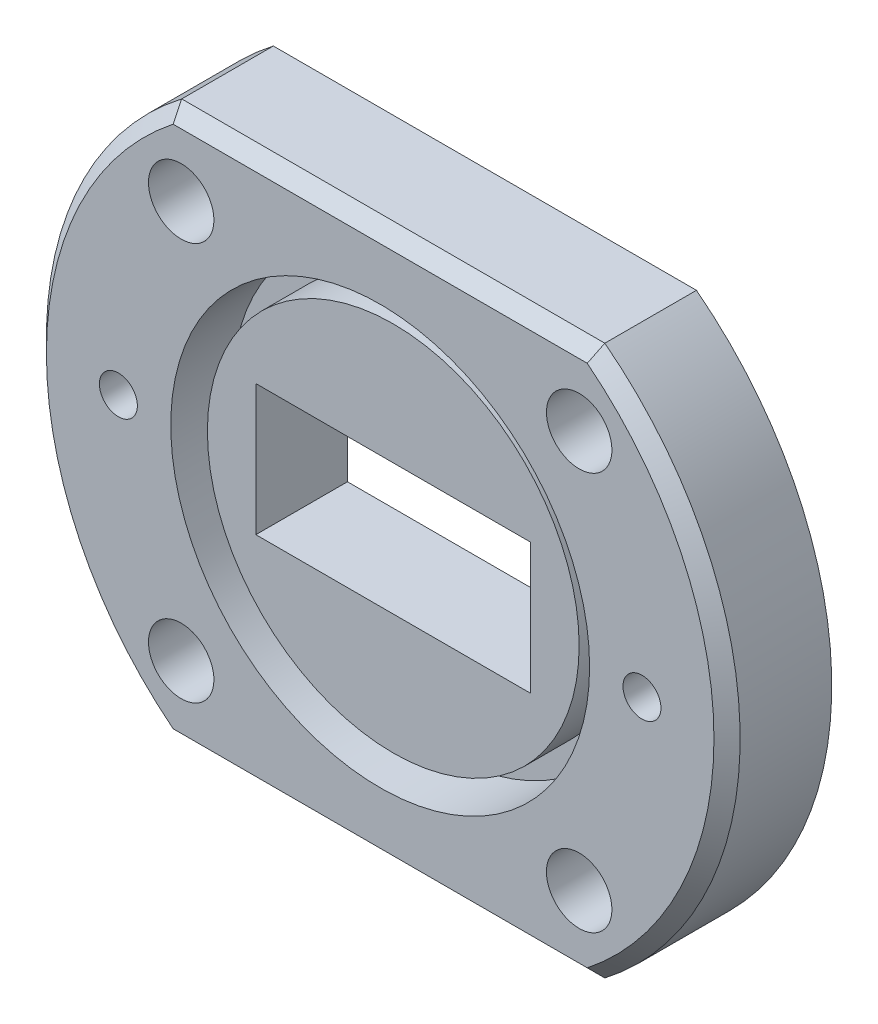
ISO-10303-21;
HEADER;
FILE_DESCRIPTION(('STEP AP214'),'2;1');
FILE_NAME('part.step','',(''),(''),'','','');
FILE_SCHEMA(('AUTOMOTIVE_DESIGN { 1 0 10303 214 1 1 1 1 }'));
ENDSEC;
DATA;
#1=APPLICATION_CONTEXT('core data for automotive mechanical design processes');
#2=APPLICATION_PROTOCOL_DEFINITION('international standard','automotive_design',2000,#1);
#3=PRODUCT_CONTEXT('',#1,'mechanical');
#4=PRODUCT('Part','Part','',(#3));
#5=PRODUCT_RELATED_PRODUCT_CATEGORY('part','',(#4));
#6=PRODUCT_DEFINITION_FORMATION('','',#4);
#7=PRODUCT_DEFINITION_CONTEXT('part definition',#1,'design');
#8=PRODUCT_DEFINITION('design','',#6,#7);
#9=PRODUCT_DEFINITION_SHAPE('','',#8);
#10=(LENGTH_UNIT() NAMED_UNIT(*) SI_UNIT(.MILLI.,.METRE.));
#11=(NAMED_UNIT(*) PLANE_ANGLE_UNIT() SI_UNIT($,.RADIAN.));
#12=(NAMED_UNIT(*) SI_UNIT($,.STERADIAN.) SOLID_ANGLE_UNIT());
#13=UNCERTAINTY_MEASURE_WITH_UNIT(LENGTH_MEASURE(1.E-05),#10,'distance_accuracy_value','');
#14=(GEOMETRIC_REPRESENTATION_CONTEXT(3) GLOBAL_UNCERTAINTY_ASSIGNED_CONTEXT((#13)) GLOBAL_UNIT_ASSIGNED_CONTEXT((#10,
#11,#12)) REPRESENTATION_CONTEXT('',''));
#15=CARTESIAN_POINT('',(0.,0.,0.));
#16=DIRECTION('',(0.,0.,1.));
#17=DIRECTION('',(1.,0.,0.));
#18=AXIS2_PLACEMENT_3D('',#15,#16,#17);
#19=CARTESIAN_POINT('',(0.,0.,8.));
#20=DIRECTION('',(0.,0.,-1.));
#21=DIRECTION('',(-1.,0.,0.));
#22=AXIS2_PLACEMENT_3D('',#19,#20,#21);
#23=CYLINDRICAL_SURFACE('',#22,26.5);
#24=CARTESIAN_POINT('',(0.,0.,7.00000000000001));
#25=DIRECTION('',(0.,0.,1.));
#26=DIRECTION('',(1.,0.,0.));
#27=AXIS2_PLACEMENT_3D('',#24,#25,#26);
#28=CIRCLE('',#27,26.5);
#29=CARTESIAN_POINT('',(16.1632298752446,21.,7.00000000000001));
#30=VERTEX_POINT('',#29);
#31=CARTESIAN_POINT('',(16.1632298752446,-21.,7.00000000000001));
#32=VERTEX_POINT('',#31);
#33=EDGE_CURVE('E136',#30,#32,#28,.F.);
#34=ORIENTED_EDGE('',*,*,#33,.T.);
#35=DIRECTION('',(0.,0.,-1.));
#36=VECTOR('',#35,1.);
#37=CARTESIAN_POINT('',(16.1632298752446,-21.,8.));
#38=LINE('',#37,#36);
#39=CARTESIAN_POINT('',(16.1632298752446,-21.,0.));
#40=VERTEX_POINT('',#39);
#41=EDGE_CURVE('E134',#32,#40,#38,.T.);
#42=ORIENTED_EDGE('',*,*,#41,.T.);
#43=CARTESIAN_POINT('',(0.,0.,0.));
#44=DIRECTION('',(0.,0.,1.));
#45=DIRECTION('',(1.,0.,0.));
#46=AXIS2_PLACEMENT_3D('',#43,#44,#45);
#47=CIRCLE('',#46,26.5);
#48=CARTESIAN_POINT('',(16.1632298752446,21.,0.));
#49=VERTEX_POINT('',#48);
#50=EDGE_CURVE('E202',#40,#49,#47,.T.);
#51=ORIENTED_EDGE('',*,*,#50,.T.);
#52=DIRECTION('',(0.,0.,-1.));
#53=VECTOR('',#52,1.);
#54=CARTESIAN_POINT('',(16.1632298752446,21.,8.));
#55=LINE('',#54,#53);
#56=EDGE_CURVE('E197',#49,#30,#55,.F.);
#57=ORIENTED_EDGE('',*,*,#56,.T.);
#58=EDGE_LOOP('',(#34,#42,#51,#57));
#59=FACE_BOUND('',#58,.T.);
#60=ADVANCED_FACE('F38',(#59),#23,.T.);
#61=CARTESIAN_POINT('',(0.,0.,8.));
#62=DIRECTION('',(0.,0.,-1.));
#63=DIRECTION('',(-1.,0.,0.));
#64=AXIS2_PLACEMENT_3D('',#61,#62,#63);
#65=CONICAL_SURFACE('',#64,25.5,0.785398163397447);
#66=CARTESIAN_POINT('',(0.,0.,8.));
#67=DIRECTION('',(0.,0.,1.));
#68=DIRECTION('',(1.,0.,0.));
#69=AXIS2_PLACEMENT_3D('',#66,#67,#68);
#70=CIRCLE('',#69,25.5);
#71=CARTESIAN_POINT('',(15.8192920195564,-20.,8.));
#72=VERTEX_POINT('',#71);
#73=CARTESIAN_POINT('',(15.8192920195564,20.,8.));
#74=VERTEX_POINT('',#73);
#75=EDGE_CURVE('E154',#72,#74,#70,.T.);
#76=ORIENTED_EDGE('',*,*,#75,.F.);
#77=CARTESIAN_POINT('',(15.8192920195564,-20.,8.));
#78=CARTESIAN_POINT('',(15.8771970048923,-20.166566584311,7.83343341568894));
#79=CARTESIAN_POINT('',(15.934810986366,-20.3331832122443,7.66681678775571));
#80=CARTESIAN_POINT('',(16.0494569382279,-20.6665165455835,7.33348345441651));
#81=CARTESIAN_POINT('',(16.1064889086503,-20.8332332509836,7.16676674901641));
#82=CARTESIAN_POINT('',(16.1632298752446,-21.,7.));
#83=B_SPLINE_CURVE_WITH_KNOTS('',3,(#77,#78,#79,#80,#81,#82),.UNSPECIFIED.,.F.,.F.,(4,2,4),(0.,
0.727718455462264,1.45543686825852),.UNSPECIFIED.);
#84=EDGE_CURVE('E47',#72,#32,#83,.T.);
#85=ORIENTED_EDGE('',*,*,#84,.T.);
#86=ORIENTED_EDGE('',*,*,#33,.F.);
#87=CARTESIAN_POINT('',(16.1632298752446,21.,7.));
#88=CARTESIAN_POINT('',(16.1064889086503,20.8332332509836,7.16676674901641));
#89=CARTESIAN_POINT('',(16.0494569382279,20.6665165455835,7.33348345441651));
#90=CARTESIAN_POINT('',(15.934810986366,20.3331832122443,7.66681678775571));
#91=CARTESIAN_POINT('',(15.8771970048923,20.166566584311,7.83343341568895));
#92=CARTESIAN_POINT('',(15.8192920195564,20.,8.));
#93=B_SPLINE_CURVE_WITH_KNOTS('',3,(#87,#88,#89,#90,#91,#92),.UNSPECIFIED.,.F.,.F.,(4,2,4),(0.,
0.727718412796261,1.45543686825852),.UNSPECIFIED.);
#94=EDGE_CURVE('E54',#30,#74,#93,.T.);
#95=ORIENTED_EDGE('',*,*,#94,.T.);
#96=EDGE_LOOP('',(#76,#85,#86,#95));
#97=FACE_BOUND('',#96,.T.);
#98=ADVANCED_FACE('F173',(#97),#65,.T.);
#99=CARTESIAN_POINT('',(-16.1632298752446,21.,0.));
#100=VERTEX_POINT('',#99);
#101=CARTESIAN_POINT('',(-16.1632298752446,-21.,0.));
#102=VERTEX_POINT('',#101);
#103=EDGE_CURVE('E146',#100,#102,#47,.T.);
#104=ORIENTED_EDGE('',*,*,#103,.T.);
#105=DIRECTION('',(0.,0.,-1.));
#106=VECTOR('',#105,1.);
#107=CARTESIAN_POINT('',(-16.1632298752446,-21.,8.));
#108=LINE('',#107,#106);
#109=CARTESIAN_POINT('',(-16.1632298752446,-21.,7.00000000000001));
#110=VERTEX_POINT('',#109);
#111=EDGE_CURVE('E131',#102,#110,#108,.F.);
#112=ORIENTED_EDGE('',*,*,#111,.T.);
#113=CARTESIAN_POINT('',(-16.1632298752446,21.,7.00000000000001));
#114=VERTEX_POINT('',#113);
#115=EDGE_CURVE('E143',#110,#114,#28,.F.);
#116=ORIENTED_EDGE('',*,*,#115,.T.);
#117=DIRECTION('',(0.,0.,-1.));
#118=VECTOR('',#117,1.);
#119=CARTESIAN_POINT('',(-16.1632298752446,21.,8.));
#120=LINE('',#119,#118);
#121=EDGE_CURVE('E199',#114,#100,#120,.T.);
#122=ORIENTED_EDGE('',*,*,#121,.T.);
#123=EDGE_LOOP('',(#104,#112,#116,#122));
#124=FACE_BOUND('',#123,.T.);
#125=ADVANCED_FACE('F141',(#124),#23,.T.);
#126=CARTESIAN_POINT('',(0.,0.,8.));
#127=DIRECTION('',(0.,0.,1.));
#128=DIRECTION('',(1.,0.,0.));
#129=AXIS2_PLACEMENT_3D('',#126,#127,#128);
#130=PLANE('',#129);
#131=CARTESIAN_POINT('',(20.,0.,8.));
#132=DIRECTION('',(0.,0.,1.));
#133=DIRECTION('',(1.,0.,0.));
#134=AXIS2_PLACEMENT_3D('',#131,#132,#133);
#135=CIRCLE('',#134,1.44999999999999);
#136=CARTESIAN_POINT('',(21.45,0.,8.));
#137=VERTEX_POINT('',#136);
#138=EDGE_CURVE('E286',#137,#137,#135,.T.);
#139=ORIENTED_EDGE('',*,*,#138,.F.);
#140=EDGE_LOOP('',(#139));
#141=FACE_BOUND('',#140,.T.);
#142=CARTESIAN_POINT('',(-20.,0.,8.));
#143=DIRECTION('',(0.,0.,1.));
#144=DIRECTION('',(1.,0.,0.));
#145=AXIS2_PLACEMENT_3D('',#142,#143,#144);
#146=CIRCLE('',#145,1.44999999999999);
#147=CARTESIAN_POINT('',(-18.55,0.,8.));
#148=VERTEX_POINT('',#147);
#149=EDGE_CURVE('E280',#148,#148,#146,.T.);
#150=ORIENTED_EDGE('',*,*,#149,.F.);
#151=EDGE_LOOP('',(#150));
#152=FACE_BOUND('',#151,.T.);
#153=CARTESIAN_POINT('',(-15.8192920195564,20.,8.));
#154=VERTEX_POINT('',#153);
#155=CARTESIAN_POINT('',(-15.8192920195564,-20.,8.));
#156=VERTEX_POINT('',#155);
#157=EDGE_CURVE('E152',#154,#156,#70,.T.);
#158=ORIENTED_EDGE('',*,*,#157,.T.);
#159=DIRECTION('',(1.,0.,0.));
#160=VECTOR('',#159,1.);
#161=CARTESIAN_POINT('',(14.4654761414895,-20.,8.));
#162=LINE('',#161,#160);
#163=EDGE_CURVE('E61',#156,#72,#162,.T.);
#164=ORIENTED_EDGE('',*,*,#163,.T.);
#165=ORIENTED_EDGE('',*,*,#75,.T.);
#166=DIRECTION('',(-1.,0.,0.));
#167=VECTOR('',#166,1.);
#168=CARTESIAN_POINT('',(-14.4654761414895,20.,8.));
#169=LINE('',#168,#167);
#170=EDGE_CURVE('E124',#74,#154,#169,.T.);
#171=ORIENTED_EDGE('',*,*,#170,.T.);
#172=EDGE_LOOP('',(#158,#164,#165,#171));
#173=FACE_BOUND('',#172,.T.);
#174=CARTESIAN_POINT('',(-15.2027957955108,-15.2027957955107,8.));
#175=DIRECTION('',(0.,0.,1.));
#176=DIRECTION('',(0.,1.,0.));
#177=AXIS2_PLACEMENT_3D('',#174,#175,#176);
#178=CIRCLE('',#177,2.5);
#179=CARTESIAN_POINT('',(-15.2027957955108,-12.7027957955107,8.));
#180=VERTEX_POINT('',#179);
#181=EDGE_CURVE('E269',#180,#180,#178,.T.);
#182=ORIENTED_EDGE('',*,*,#181,.F.);
#183=EDGE_LOOP('',(#182));
#184=FACE_BOUND('',#183,.T.);
#185=CARTESIAN_POINT('',(15.2027957955109,-15.2027957955107,8.));
#186=DIRECTION('',(0.,0.,1.));
#187=DIRECTION('',(-1.,0.,0.));
#188=AXIS2_PLACEMENT_3D('',#185,#186,#187);
#189=CIRCLE('',#188,2.5);
#190=CARTESIAN_POINT('',(12.7027957955109,-15.2027957955107,8.));
#191=VERTEX_POINT('',#190);
#192=EDGE_CURVE('E263',#191,#191,#189,.T.);
#193=ORIENTED_EDGE('',*,*,#192,.F.);
#194=EDGE_LOOP('',(#193));
#195=FACE_BOUND('',#194,.T.);
#196=CARTESIAN_POINT('',(15.2027957955107,15.2027957955108,8.));
#197=DIRECTION('',(0.,0.,1.));
#198=DIRECTION('',(0.,-1.,0.));
#199=AXIS2_PLACEMENT_3D('',#196,#197,#198);
#200=CIRCLE('',#199,2.5);
#201=CARTESIAN_POINT('',(15.2027957955107,12.7027957955108,8.));
#202=VERTEX_POINT('',#201);
#203=EDGE_CURVE('E257',#202,#202,#200,.T.);
#204=ORIENTED_EDGE('',*,*,#203,.F.);
#205=EDGE_LOOP('',(#204));
#206=FACE_BOUND('',#205,.T.);
#207=CARTESIAN_POINT('',(-15.2027957955109,15.2027957955107,8.));
#208=DIRECTION('',(0.,0.,1.));
#209=DIRECTION('',(1.,0.,0.));
#210=AXIS2_PLACEMENT_3D('',#207,#208,#209);
#211=CIRCLE('',#210,2.5);
#212=CARTESIAN_POINT('',(-12.7027957955109,15.2027957955107,8.));
#213=VERTEX_POINT('',#212);
#214=EDGE_CURVE('E251',#213,#213,#211,.T.);
#215=ORIENTED_EDGE('',*,*,#214,.F.);
#216=EDGE_LOOP('',(#215));
#217=FACE_BOUND('',#216,.T.);
#218=CARTESIAN_POINT('',(0.,0.,8.));
#219=DIRECTION('',(0.,0.,1.));
#220=DIRECTION('',(1.,0.,0.));
#221=AXIS2_PLACEMENT_3D('',#218,#219,#220);
#222=CIRCLE('',#221,16.);
#223=CARTESIAN_POINT('',(16.,0.,8.));
#224=VERTEX_POINT('',#223);
#225=EDGE_CURVE('E205',#224,#224,#222,.T.);
#226=ORIENTED_EDGE('',*,*,#225,.F.);
#227=EDGE_LOOP('',(#226));
#228=FACE_BOUND('',#227,.T.);
#229=ADVANCED_FACE('F190',(#141,#152,#173,#184,#195,#206,#217,#228),#130,.T.);
#230=CARTESIAN_POINT('',(0.,0.,0.));
#231=DIRECTION('',(0.,0.,1.));
#232=DIRECTION('',(1.,0.,0.));
#233=AXIS2_PLACEMENT_3D('',#230,#231,#232);
#234=PLANE('',#233);
#235=CARTESIAN_POINT('',(20.,0.,0.));
#236=DIRECTION('',(0.,0.,1.));
#237=DIRECTION('',(1.,0.,0.));
#238=AXIS2_PLACEMENT_3D('',#235,#236,#237);
#239=CIRCLE('',#238,1.45);
#240=CARTESIAN_POINT('',(21.45,0.,0.));
#241=VERTEX_POINT('',#240);
#242=EDGE_CURVE('E283',#241,#241,#239,.T.);
#243=ORIENTED_EDGE('',*,*,#242,.T.);
#244=EDGE_LOOP('',(#243));
#245=FACE_BOUND('',#244,.T.);
#246=CARTESIAN_POINT('',(-20.,0.,0.));
#247=DIRECTION('',(0.,0.,1.));
#248=DIRECTION('',(1.,0.,0.));
#249=AXIS2_PLACEMENT_3D('',#246,#247,#248);
#250=CIRCLE('',#249,1.45);
#251=CARTESIAN_POINT('',(-18.55,0.,0.));
#252=VERTEX_POINT('',#251);
#253=EDGE_CURVE('E148',#252,#252,#250,.T.);
#254=ORIENTED_EDGE('',*,*,#253,.T.);
#255=EDGE_LOOP('',(#254));
#256=FACE_BOUND('',#255,.T.);
#257=CARTESIAN_POINT('',(-15.2027957955108,-15.2027957955107,0.));
#258=DIRECTION('',(0.,0.,1.));
#259=DIRECTION('',(0.,1.,0.));
#260=AXIS2_PLACEMENT_3D('',#257,#258,#259);
#261=CIRCLE('',#260,2.5);
#262=CARTESIAN_POINT('',(-15.2027957955108,-12.7027957955107,0.));
#263=VERTEX_POINT('',#262);
#264=EDGE_CURVE('E266',#263,#263,#261,.T.);
#265=ORIENTED_EDGE('',*,*,#264,.T.);
#266=EDGE_LOOP('',(#265));
#267=FACE_BOUND('',#266,.T.);
#268=CARTESIAN_POINT('',(15.2027957955109,-15.2027957955107,0.));
#269=DIRECTION('',(0.,0.,1.));
#270=DIRECTION('',(-1.,0.,0.));
#271=AXIS2_PLACEMENT_3D('',#268,#269,#270);
#272=CIRCLE('',#271,2.5);
#273=CARTESIAN_POINT('',(12.7027957955109,-15.2027957955107,0.));
#274=VERTEX_POINT('',#273);
#275=EDGE_CURVE('E260',#274,#274,#272,.T.);
#276=ORIENTED_EDGE('',*,*,#275,.T.);
#277=EDGE_LOOP('',(#276));
#278=FACE_BOUND('',#277,.T.);
#279=CARTESIAN_POINT('',(15.2027957955107,15.2027957955108,0.));
#280=DIRECTION('',(0.,0.,1.));
#281=DIRECTION('',(0.,-1.,0.));
#282=AXIS2_PLACEMENT_3D('',#279,#280,#281);
#283=CIRCLE('',#282,2.5);
#284=CARTESIAN_POINT('',(15.2027957955107,12.7027957955108,0.));
#285=VERTEX_POINT('',#284);
#286=EDGE_CURVE('E254',#285,#285,#283,.T.);
#287=ORIENTED_EDGE('',*,*,#286,.T.);
#288=EDGE_LOOP('',(#287));
#289=FACE_BOUND('',#288,.T.);
#290=CARTESIAN_POINT('',(-15.2027957955109,15.2027957955107,0.));
#291=DIRECTION('',(0.,0.,1.));
#292=DIRECTION('',(1.,0.,0.));
#293=AXIS2_PLACEMENT_3D('',#290,#291,#292);
#294=CIRCLE('',#293,2.5);
#295=CARTESIAN_POINT('',(-12.7027957955109,15.2027957955107,0.));
#296=VERTEX_POINT('',#295);
#297=EDGE_CURVE('E240',#296,#296,#294,.T.);
#298=ORIENTED_EDGE('',*,*,#297,.T.);
#299=EDGE_LOOP('',(#298));
#300=FACE_BOUND('',#299,.T.);
#301=DIRECTION('',(1.,0.,0.));
#302=VECTOR('',#301,1.);
#303=CARTESIAN_POINT('',(-10.5,-5.,0.));
#304=LINE('',#303,#302);
#305=CARTESIAN_POINT('',(-10.5,-5.,0.));
#306=VERTEX_POINT('',#305);
#307=CARTESIAN_POINT('',(10.5,-5.,0.));
#308=VERTEX_POINT('',#307);
#309=EDGE_CURVE('E223',#306,#308,#304,.T.);
#310=ORIENTED_EDGE('',*,*,#309,.T.);
#311=DIRECTION('',(0.,1.,0.));
#312=VECTOR('',#311,1.);
#313=CARTESIAN_POINT('',(10.5,-5.,0.));
#314=LINE('',#313,#312);
#315=CARTESIAN_POINT('',(10.5,5.,0.));
#316=VERTEX_POINT('',#315);
#317=EDGE_CURVE('E231',#308,#316,#314,.T.);
#318=ORIENTED_EDGE('',*,*,#317,.T.);
#319=DIRECTION('',(-1.,0.,0.));
#320=VECTOR('',#319,1.);
#321=CARTESIAN_POINT('',(-10.5,5.,0.));
#322=LINE('',#321,#320);
#323=CARTESIAN_POINT('',(-10.5,5.,0.));
#324=VERTEX_POINT('',#323);
#325=EDGE_CURVE('E246',#316,#324,#322,.T.);
#326=ORIENTED_EDGE('',*,*,#325,.T.);
#327=DIRECTION('',(0.,-1.,0.));
#328=VECTOR('',#327,1.);
#329=CARTESIAN_POINT('',(-10.5,-5.,0.));
#330=LINE('',#329,#328);
#331=EDGE_CURVE('E243',#324,#306,#330,.T.);
#332=ORIENTED_EDGE('',*,*,#331,.T.);
#333=EDGE_LOOP('',(#310,#318,#326,#332));
#334=FACE_BOUND('',#333,.T.);
#335=ORIENTED_EDGE('',*,*,#50,.F.);
#336=DIRECTION('',(-1.,0.,0.));
#337=VECTOR('',#336,1.);
#338=CARTESIAN_POINT('',(0.,-21.,0.));
#339=LINE('',#338,#337);
#340=EDGE_CURVE('E147',#40,#102,#339,.T.);
#341=ORIENTED_EDGE('',*,*,#340,.T.);
#342=ORIENTED_EDGE('',*,*,#103,.F.);
#343=DIRECTION('',(1.,0.,0.));
#344=VECTOR('',#343,1.);
#345=CARTESIAN_POINT('',(0.,21.,0.));
#346=LINE('',#345,#344);
#347=EDGE_CURVE('E203',#100,#49,#346,.T.);
#348=ORIENTED_EDGE('',*,*,#347,.T.);
#349=EDGE_LOOP('',(#335,#341,#342,#348));
#350=FACE_BOUND('',#349,.T.);
#351=ADVANCED_FACE('F294',(#245,#256,#267,#278,#289,#300,#334,#350),#234,.F.);
#352=CARTESIAN_POINT('',(0.,0.,7.));
#353=DIRECTION('',(0.,0.,1.));
#354=DIRECTION('',(1.,0.,0.));
#355=AXIS2_PLACEMENT_3D('',#352,#353,#354);
#356=CYLINDRICAL_SURFACE('',#355,16.);
#357=ORIENTED_EDGE('',*,*,#225,.T.);
#358=EDGE_LOOP('',(#357));
#359=FACE_BOUND('',#358,.T.);
#360=CARTESIAN_POINT('',(0.,0.,3.3));
#361=DIRECTION('',(0.,0.,1.));
#362=DIRECTION('',(1.,0.,0.));
#363=AXIS2_PLACEMENT_3D('',#360,#361,#362);
#364=CIRCLE('',#363,16.);
#365=CARTESIAN_POINT('',(16.,0.,3.3));
#366=VERTEX_POINT('',#365);
#367=EDGE_CURVE('E209',#366,#366,#364,.T.);
#368=ORIENTED_EDGE('',*,*,#367,.F.);
#369=EDGE_LOOP('',(#368));
#370=FACE_BOUND('',#369,.T.);
#371=ADVANCED_FACE('F330',(#359,#370),#356,.F.);
#372=CARTESIAN_POINT('',(0.,0.,3.3));
#373=DIRECTION('',(0.,0.,1.));
#374=DIRECTION('',(1.,0.,0.));
#375=AXIS2_PLACEMENT_3D('',#372,#373,#374);
#376=PLANE('',#375);
#377=CARTESIAN_POINT('',(0.,0.,3.3));
#378=DIRECTION('',(0.,0.,1.));
#379=DIRECTION('',(1.,0.,0.));
#380=AXIS2_PLACEMENT_3D('',#377,#378,#379);
#381=CIRCLE('',#380,14.2);
#382=CARTESIAN_POINT('',(14.2,0.,3.3));
#383=VERTEX_POINT('',#382);
#384=EDGE_CURVE('E212',#383,#383,#381,.T.);
#385=ORIENTED_EDGE('',*,*,#384,.F.);
#386=EDGE_LOOP('',(#385));
#387=FACE_BOUND('',#386,.T.);
#388=ORIENTED_EDGE('',*,*,#367,.T.);
#389=EDGE_LOOP('',(#388));
#390=FACE_BOUND('',#389,.T.);
#391=ADVANCED_FACE('F339',(#387,#390),#376,.T.);
#392=CARTESIAN_POINT('',(0.,0.,3.3));
#393=DIRECTION('',(0.,0.,1.));
#394=DIRECTION('',(1.,0.,0.));
#395=AXIS2_PLACEMENT_3D('',#392,#393,#394);
#396=CYLINDRICAL_SURFACE('',#395,14.2);
#397=ORIENTED_EDGE('',*,*,#384,.T.);
#398=EDGE_LOOP('',(#397));
#399=FACE_BOUND('',#398,.T.);
#400=CARTESIAN_POINT('',(0.,0.,7.));
#401=DIRECTION('',(0.,0.,1.));
#402=DIRECTION('',(1.,0.,0.));
#403=AXIS2_PLACEMENT_3D('',#400,#401,#402);
#404=CIRCLE('',#403,14.2);
#405=CARTESIAN_POINT('',(14.2,0.,7.));
#406=VERTEX_POINT('',#405);
#407=EDGE_CURVE('E213',#406,#406,#404,.T.);
#408=ORIENTED_EDGE('',*,*,#407,.F.);
#409=EDGE_LOOP('',(#408));
#410=FACE_BOUND('',#409,.T.);
#411=ADVANCED_FACE('F347',(#399,#410),#396,.T.);
#412=CARTESIAN_POINT('',(0.,0.,7.));
#413=DIRECTION('',(0.,0.,1.));
#414=DIRECTION('',(1.,0.,0.));
#415=AXIS2_PLACEMENT_3D('',#412,#413,#414);
#416=PLANE('',#415);
#417=DIRECTION('',(0.,1.,0.));
#418=VECTOR('',#417,1.);
#419=CARTESIAN_POINT('',(10.5,-5.,7.));
#420=LINE('',#419,#418);
#421=CARTESIAN_POINT('',(10.5,-5.,7.));
#422=VERTEX_POINT('',#421);
#423=CARTESIAN_POINT('',(10.5,5.,7.));
#424=VERTEX_POINT('',#423);
#425=EDGE_CURVE('E238',#422,#424,#420,.T.);
#426=ORIENTED_EDGE('',*,*,#425,.F.);
#427=DIRECTION('',(1.,0.,0.));
#428=VECTOR('',#427,1.);
#429=CARTESIAN_POINT('',(-10.5,-5.,7.));
#430=LINE('',#429,#428);
#431=CARTESIAN_POINT('',(-10.5,-5.,7.));
#432=VERTEX_POINT('',#431);
#433=EDGE_CURVE('E228',#432,#422,#430,.T.);
#434=ORIENTED_EDGE('',*,*,#433,.F.);
#435=DIRECTION('',(0.,-1.,0.));
#436=VECTOR('',#435,1.);
#437=CARTESIAN_POINT('',(-10.5,-5.,7.));
#438=LINE('',#437,#436);
#439=CARTESIAN_POINT('',(-10.5,5.,7.));
#440=VERTEX_POINT('',#439);
#441=EDGE_CURVE('E232',#440,#432,#438,.T.);
#442=ORIENTED_EDGE('',*,*,#441,.F.);
#443=DIRECTION('',(-1.,0.,0.));
#444=VECTOR('',#443,1.);
#445=CARTESIAN_POINT('',(-10.5,5.,7.));
#446=LINE('',#445,#444);
#447=EDGE_CURVE('E235',#424,#440,#446,.T.);
#448=ORIENTED_EDGE('',*,*,#447,.F.);
#449=EDGE_LOOP('',(#426,#434,#442,#448));
#450=FACE_BOUND('',#449,.T.);
#451=ORIENTED_EDGE('',*,*,#407,.T.);
#452=EDGE_LOOP('',(#451));
#453=FACE_BOUND('',#452,.T.);
#454=ADVANCED_FACE('F355',(#450,#453),#416,.T.);
#455=CARTESIAN_POINT('',(10.5,-5.,0.));
#456=DIRECTION('',(1.,0.,0.));
#457=DIRECTION('',(0.,0.,-1.));
#458=AXIS2_PLACEMENT_3D('',#455,#456,#457);
#459=PLANE('',#458);
#460=ORIENTED_EDGE('',*,*,#425,.T.);
#461=DIRECTION('',(0.,0.,1.));
#462=VECTOR('',#461,1.);
#463=CARTESIAN_POINT('',(10.5,5.,0.));
#464=LINE('',#463,#462);
#465=EDGE_CURVE('E219',#316,#424,#464,.T.);
#466=ORIENTED_EDGE('',*,*,#465,.F.);
#467=ORIENTED_EDGE('',*,*,#317,.F.);
#468=DIRECTION('',(0.,0.,1.));
#469=VECTOR('',#468,1.);
#470=CARTESIAN_POINT('',(10.5,-5.,0.));
#471=LINE('',#470,#469);
#472=EDGE_CURVE('E216',#308,#422,#471,.T.);
#473=ORIENTED_EDGE('',*,*,#472,.T.);
#474=EDGE_LOOP('',(#460,#466,#467,#473));
#475=FACE_BOUND('',#474,.T.);
#476=ADVANCED_FACE('F363',(#475),#459,.F.);
#477=CARTESIAN_POINT('',(-10.5,-5.,0.));
#478=DIRECTION('',(0.,-1.,0.));
#479=DIRECTION('',(0.,0.,-1.));
#480=AXIS2_PLACEMENT_3D('',#477,#478,#479);
#481=PLANE('',#480);
#482=ORIENTED_EDGE('',*,*,#433,.T.);
#483=ORIENTED_EDGE('',*,*,#472,.F.);
#484=ORIENTED_EDGE('',*,*,#309,.F.);
#485=DIRECTION('',(0.,0.,1.));
#486=VECTOR('',#485,1.);
#487=CARTESIAN_POINT('',(-10.5,-5.,0.));
#488=LINE('',#487,#486);
#489=EDGE_CURVE('E225',#306,#432,#488,.T.);
#490=ORIENTED_EDGE('',*,*,#489,.T.);
#491=EDGE_LOOP('',(#482,#483,#484,#490));
#492=FACE_BOUND('',#491,.T.);
#493=ADVANCED_FACE('F371',(#492),#481,.F.);
#494=CARTESIAN_POINT('',(-10.5,-5.,0.));
#495=DIRECTION('',(-1.,0.,0.));
#496=DIRECTION('',(0.,0.,1.));
#497=AXIS2_PLACEMENT_3D('',#494,#495,#496);
#498=PLANE('',#497);
#499=ORIENTED_EDGE('',*,*,#441,.T.);
#500=ORIENTED_EDGE('',*,*,#489,.F.);
#501=ORIENTED_EDGE('',*,*,#331,.F.);
#502=DIRECTION('',(0.,0.,1.));
#503=VECTOR('',#502,1.);
#504=CARTESIAN_POINT('',(-10.5,5.,0.));
#505=LINE('',#504,#503);
#506=EDGE_CURVE('E222',#324,#440,#505,.T.);
#507=ORIENTED_EDGE('',*,*,#506,.T.);
#508=EDGE_LOOP('',(#499,#500,#501,#507));
#509=FACE_BOUND('',#508,.T.);
#510=ADVANCED_FACE('F379',(#509),#498,.F.);
#511=CARTESIAN_POINT('',(-10.5,5.,0.));
#512=DIRECTION('',(0.,1.,0.));
#513=DIRECTION('',(0.,0.,1.));
#514=AXIS2_PLACEMENT_3D('',#511,#512,#513);
#515=PLANE('',#514);
#516=ORIENTED_EDGE('',*,*,#447,.T.);
#517=ORIENTED_EDGE('',*,*,#506,.F.);
#518=ORIENTED_EDGE('',*,*,#325,.F.);
#519=ORIENTED_EDGE('',*,*,#465,.T.);
#520=EDGE_LOOP('',(#516,#517,#518,#519));
#521=FACE_BOUND('',#520,.T.);
#522=ADVANCED_FACE('F387',(#521),#515,.F.);
#523=CARTESIAN_POINT('',(-15.2027957955109,15.2027957955107,0.));
#524=DIRECTION('',(0.,0.,1.));
#525=DIRECTION('',(1.,0.,0.));
#526=AXIS2_PLACEMENT_3D('',#523,#524,#525);
#527=CYLINDRICAL_SURFACE('',#526,2.5);
#528=ORIENTED_EDGE('',*,*,#297,.F.);
#529=EDGE_LOOP('',(#528));
#530=FACE_BOUND('',#529,.T.);
#531=ORIENTED_EDGE('',*,*,#214,.T.);
#532=EDGE_LOOP('',(#531));
#533=FACE_BOUND('',#532,.T.);
#534=ADVANCED_FACE('F395',(#530,#533),#527,.F.);
#535=CARTESIAN_POINT('',(15.2027957955107,15.2027957955108,0.));
#536=DIRECTION('',(0.,0.,1.));
#537=DIRECTION('',(1.,0.,0.));
#538=AXIS2_PLACEMENT_3D('',#535,#536,#537);
#539=CYLINDRICAL_SURFACE('',#538,2.5);
#540=ORIENTED_EDGE('',*,*,#286,.F.);
#541=EDGE_LOOP('',(#540));
#542=FACE_BOUND('',#541,.T.);
#543=ORIENTED_EDGE('',*,*,#203,.T.);
#544=EDGE_LOOP('',(#543));
#545=FACE_BOUND('',#544,.T.);
#546=ADVANCED_FACE('F403',(#542,#545),#539,.F.);
#547=CARTESIAN_POINT('',(15.2027957955109,-15.2027957955107,0.));
#548=DIRECTION('',(0.,0.,1.));
#549=DIRECTION('',(1.,0.,0.));
#550=AXIS2_PLACEMENT_3D('',#547,#548,#549);
#551=CYLINDRICAL_SURFACE('',#550,2.5);
#552=ORIENTED_EDGE('',*,*,#275,.F.);
#553=EDGE_LOOP('',(#552));
#554=FACE_BOUND('',#553,.T.);
#555=ORIENTED_EDGE('',*,*,#192,.T.);
#556=EDGE_LOOP('',(#555));
#557=FACE_BOUND('',#556,.T.);
#558=ADVANCED_FACE('F411',(#554,#557),#551,.F.);
#559=CARTESIAN_POINT('',(-15.2027957955108,-15.2027957955107,0.));
#560=DIRECTION('',(0.,0.,1.));
#561=DIRECTION('',(1.,0.,0.));
#562=AXIS2_PLACEMENT_3D('',#559,#560,#561);
#563=CYLINDRICAL_SURFACE('',#562,2.5);
#564=ORIENTED_EDGE('',*,*,#264,.F.);
#565=EDGE_LOOP('',(#564));
#566=FACE_BOUND('',#565,.T.);
#567=ORIENTED_EDGE('',*,*,#181,.T.);
#568=EDGE_LOOP('',(#567));
#569=FACE_BOUND('',#568,.T.);
#570=ADVANCED_FACE('F172',(#566,#569),#563,.F.);
#571=ORIENTED_EDGE('',*,*,#115,.F.);
#572=CARTESIAN_POINT('',(-16.1632298752446,-21.,7.));
#573=CARTESIAN_POINT('',(-16.1064889086503,-20.8332332509836,7.16676674901641));
#574=CARTESIAN_POINT('',(-16.0494569382279,-20.6665165455835,7.33348345441651));
#575=CARTESIAN_POINT('',(-15.934810986366,-20.3331832122443,7.66681678775571));
#576=CARTESIAN_POINT('',(-15.8771970048923,-20.166566584311,7.83343341568895));
#577=CARTESIAN_POINT('',(-15.8192920195564,-20.,8.));
#578=B_SPLINE_CURVE_WITH_KNOTS('',3,(#572,#573,#574,#575,#576,#577),.UNSPECIFIED.,.F.,.F.,(4,2,
4),(0.,0.727718412796261,1.45543686825852),.UNSPECIFIED.);
#579=EDGE_CURVE('E116',#110,#156,#578,.T.);
#580=ORIENTED_EDGE('',*,*,#579,.T.);
#581=ORIENTED_EDGE('',*,*,#157,.F.);
#582=CARTESIAN_POINT('',(-15.8192920195564,20.,8.));
#583=CARTESIAN_POINT('',(-15.8771970048923,20.166566584311,7.83343341568894));
#584=CARTESIAN_POINT('',(-15.934810986366,20.3331832122443,7.66681678775571));
#585=CARTESIAN_POINT('',(-16.0494569382279,20.6665165455835,7.33348345441651));
#586=CARTESIAN_POINT('',(-16.1064889086503,20.8332332509836,7.16676674901641));
#587=CARTESIAN_POINT('',(-16.1632298752446,21.,7.));
#588=B_SPLINE_CURVE_WITH_KNOTS('',3,(#582,#583,#584,#585,#586,#587),.UNSPECIFIED.,.F.,.F.,(4,2,
4),(0.,0.727718455462264,1.45543686825852),.UNSPECIFIED.);
#589=EDGE_CURVE('E125',#154,#114,#588,.T.);
#590=ORIENTED_EDGE('',*,*,#589,.T.);
#591=EDGE_LOOP('',(#571,#580,#581,#590));
#592=FACE_BOUND('',#591,.T.);
#593=ADVANCED_FACE('F150',(#592),#65,.T.);
#594=CARTESIAN_POINT('',(0.,21.,0.));
#595=DIRECTION('',(0.,-1.,0.));
#596=DIRECTION('',(0.,0.,-1.));
#597=AXIS2_PLACEMENT_3D('',#594,#595,#596);
#598=PLANE('',#597);
#599=ORIENTED_EDGE('',*,*,#121,.F.);
#600=DIRECTION('',(1.,0.,0.));
#601=VECTOR('',#600,1.);
#602=CARTESIAN_POINT('',(14.4654761414895,21.,7.));
#603=LINE('',#602,#601);
#604=EDGE_CURVE('E11',#114,#30,#603,.T.);
#605=ORIENTED_EDGE('',*,*,#604,.T.);
#606=ORIENTED_EDGE('',*,*,#56,.F.);
#607=ORIENTED_EDGE('',*,*,#347,.F.);
#608=EDGE_LOOP('',(#599,#605,#606,#607));
#609=FACE_BOUND('',#608,.T.);
#610=ADVANCED_FACE('F171',(#609),#598,.F.);
#611=CARTESIAN_POINT('',(0.,-21.,0.));
#612=DIRECTION('',(0.,1.,0.));
#613=DIRECTION('',(0.,0.,-1.));
#614=AXIS2_PLACEMENT_3D('',#611,#612,#613);
#615=PLANE('',#614);
#616=ORIENTED_EDGE('',*,*,#41,.F.);
#617=DIRECTION('',(-1.,0.,0.));
#618=VECTOR('',#617,1.);
#619=CARTESIAN_POINT('',(-14.4654761414895,-21.,7.));
#620=LINE('',#619,#618);
#621=EDGE_CURVE('E120',#32,#110,#620,.T.);
#622=ORIENTED_EDGE('',*,*,#621,.T.);
#623=ORIENTED_EDGE('',*,*,#111,.F.);
#624=ORIENTED_EDGE('',*,*,#340,.F.);
#625=EDGE_LOOP('',(#616,#622,#623,#624));
#626=FACE_BOUND('',#625,.T.);
#627=ADVANCED_FACE('F130',(#626),#615,.F.);
#628=CARTESIAN_POINT('',(-20.,0.,8.));
#629=DIRECTION('',(0.,0.,1.));
#630=DIRECTION('',(1.,0.,0.));
#631=AXIS2_PLACEMENT_3D('',#628,#629,#630);
#632=CYLINDRICAL_SURFACE('',#631,1.44999999999999);
#633=ORIENTED_EDGE('',*,*,#253,.F.);
#634=EDGE_LOOP('',(#633));
#635=FACE_BOUND('',#634,.T.);
#636=ORIENTED_EDGE('',*,*,#149,.T.);
#637=EDGE_LOOP('',(#636));
#638=FACE_BOUND('',#637,.T.);
#639=ADVANCED_FACE('F298',(#635,#638),#632,.F.);
#640=CARTESIAN_POINT('',(20.,0.,8.));
#641=DIRECTION('',(0.,0.,1.));
#642=DIRECTION('',(1.,0.,0.));
#643=AXIS2_PLACEMENT_3D('',#640,#641,#642);
#644=CYLINDRICAL_SURFACE('',#643,1.44999999999999);
#645=ORIENTED_EDGE('',*,*,#242,.F.);
#646=EDGE_LOOP('',(#645));
#647=FACE_BOUND('',#646,.T.);
#648=ORIENTED_EDGE('',*,*,#138,.T.);
#649=EDGE_LOOP('',(#648));
#650=FACE_BOUND('',#649,.T.);
#651=ADVANCED_FACE('F290',(#647,#650),#644,.F.);
#652=CARTESIAN_POINT('',(0.,-21.,7.));
#653=DIRECTION('',(0.,-0.707106781186545,0.70710678118655));
#654=DIRECTION('',(1.,0.,0.));
#655=AXIS2_PLACEMENT_3D('',#652,#653,#654);
#656=PLANE('',#655);
#657=ORIENTED_EDGE('',*,*,#84,.F.);
#658=ORIENTED_EDGE('',*,*,#163,.F.);
#659=ORIENTED_EDGE('',*,*,#579,.F.);
#660=ORIENTED_EDGE('',*,*,#621,.F.);
#661=EDGE_LOOP('',(#657,#658,#659,#660));
#662=FACE_BOUND('',#661,.T.);
#663=ADVANCED_FACE('F119',(#662),#656,.T.);
#664=CARTESIAN_POINT('',(0.,21.,7.));
#665=DIRECTION('',(0.,0.707106781186545,0.70710678118655));
#666=DIRECTION('',(-1.,0.,0.));
#667=AXIS2_PLACEMENT_3D('',#664,#665,#666);
#668=PLANE('',#667);
#669=ORIENTED_EDGE('',*,*,#589,.F.);
#670=ORIENTED_EDGE('',*,*,#170,.F.);
#671=ORIENTED_EDGE('',*,*,#94,.F.);
#672=ORIENTED_EDGE('',*,*,#604,.F.);
#673=EDGE_LOOP('',(#669,#670,#671,#672));
#674=FACE_BOUND('',#673,.T.);
#675=ADVANCED_FACE('F40',(#674),#668,.T.);
#676=CLOSED_SHELL('',(#60,#98,#125,#229,#351,#371,#391,#411,#454,#476,#493,#510,#522,#534,#546,
#558,#570,#593,#610,#627,#639,#651,#663,#675));
#677=MANIFOLD_SOLID_BREP('B2',#676);
#678=ADVANCED_BREP_SHAPE_REPRESENTATION('',(#18,#677),#14);
#679=SHAPE_DEFINITION_REPRESENTATION(#9,#678);
ENDSEC;
END-ISO-10303-21;
